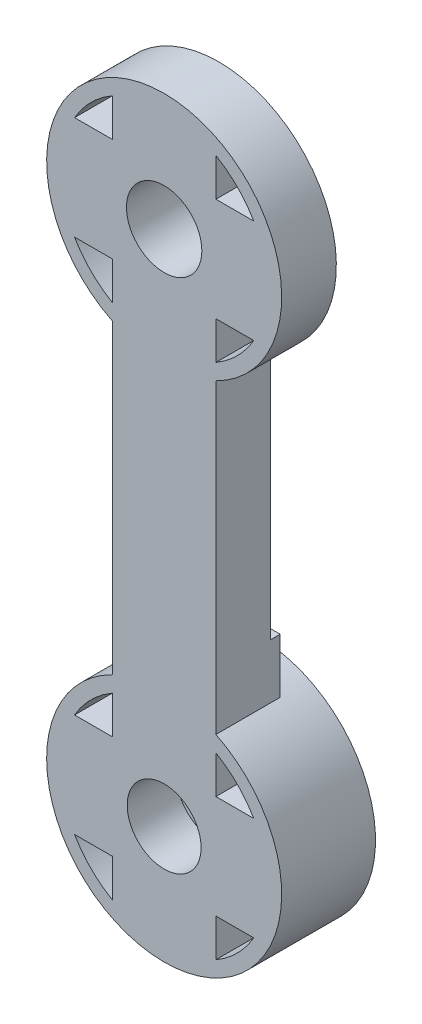
ISO-10303-21;
HEADER;
FILE_DESCRIPTION(('STEP AP214'),'2;1');
FILE_NAME('part.step','',(''),(''),'','','');
FILE_SCHEMA(('AUTOMOTIVE_DESIGN { 1 0 10303 214 1 1 1 1 }'));
ENDSEC;
DATA;
#1=APPLICATION_CONTEXT('core data for automotive mechanical design processes');
#2=APPLICATION_PROTOCOL_DEFINITION('international standard','automotive_design',2000,#1);
#3=PRODUCT_CONTEXT('',#1,'mechanical');
#4=PRODUCT('Part','Part','',(#3));
#5=PRODUCT_RELATED_PRODUCT_CATEGORY('part','',(#4));
#6=PRODUCT_DEFINITION_FORMATION('','',#4);
#7=PRODUCT_DEFINITION_CONTEXT('part definition',#1,'design');
#8=PRODUCT_DEFINITION('design','',#6,#7);
#9=PRODUCT_DEFINITION_SHAPE('','',#8);
#10=(LENGTH_UNIT() NAMED_UNIT(*) SI_UNIT(.MILLI.,.METRE.));
#11=(NAMED_UNIT(*) PLANE_ANGLE_UNIT() SI_UNIT($,.RADIAN.));
#12=(NAMED_UNIT(*) SI_UNIT($,.STERADIAN.) SOLID_ANGLE_UNIT());
#13=UNCERTAINTY_MEASURE_WITH_UNIT(LENGTH_MEASURE(1.E-05),#10,'distance_accuracy_value','');
#14=(GEOMETRIC_REPRESENTATION_CONTEXT(3) GLOBAL_UNCERTAINTY_ASSIGNED_CONTEXT((#13)) GLOBAL_UNIT_ASSIGNED_CONTEXT((#10,
#11,#12)) REPRESENTATION_CONTEXT('',''));
#15=CARTESIAN_POINT('',(0.,0.,0.));
#16=DIRECTION('',(0.,0.,1.));
#17=DIRECTION('',(1.,0.,0.));
#18=AXIS2_PLACEMENT_3D('',#15,#16,#17);
#19=CARTESIAN_POINT('',(0.,0.,-0.7));
#20=DIRECTION('',(0.,0.,-1.));
#21=DIRECTION('',(-1.,0.,0.));
#22=AXIS2_PLACEMENT_3D('',#19,#20,#21);
#23=PLANE('',#22);
#24=CARTESIAN_POINT('',(0.,0.,-0.7));
#25=DIRECTION('',(0.,0.,-1.));
#26=DIRECTION('',(-1.,0.,0.));
#27=AXIS2_PLACEMENT_3D('',#24,#25,#26);
#28=CIRCLE('',#27,2.55);
#29=CARTESIAN_POINT('',(-2.55,0.,-0.7));
#30=VERTEX_POINT('',#29);
#31=EDGE_CURVE('E277',#30,#30,#28,.T.);
#32=ORIENTED_EDGE('',*,*,#31,.F.);
#33=EDGE_LOOP('',(#32));
#34=FACE_BOUND('',#33,.T.);
#35=DIRECTION('',(0.,1.,0.));
#36=VECTOR('',#35,1.);
#37=CARTESIAN_POINT('',(-3.5,0.,-0.7));
#38=LINE('',#37,#36);
#39=CARTESIAN_POINT('',(-3.5,3.5,-0.7));
#40=VERTEX_POINT('',#39);
#41=CARTESIAN_POINT('',(-3.5,6.06217782649107,-0.7));
#42=VERTEX_POINT('',#41);
#43=EDGE_CURVE('E379',#40,#42,#38,.T.);
#44=ORIENTED_EDGE('',*,*,#43,.T.);
#45=CARTESIAN_POINT('',(0.,0.,-0.7));
#46=DIRECTION('',(0.,0.,1.));
#47=DIRECTION('',(1.,0.,0.));
#48=AXIS2_PLACEMENT_3D('',#45,#46,#47);
#49=CIRCLE('',#48,7.);
#50=CARTESIAN_POINT('',(-6.06217782649107,3.5,-0.7));
#51=VERTEX_POINT('',#50);
#52=EDGE_CURVE('E378',#42,#51,#49,.T.);
#53=ORIENTED_EDGE('',*,*,#52,.T.);
#54=DIRECTION('',(-1.,0.,0.));
#55=VECTOR('',#54,1.);
#56=CARTESIAN_POINT('',(0.,3.5,-0.7));
#57=LINE('',#56,#55);
#58=EDGE_CURVE('E382',#40,#51,#57,.T.);
#59=ORIENTED_EDGE('',*,*,#58,.F.);
#60=EDGE_LOOP('',(#44,#53,#59));
#61=FACE_BOUND('',#60,.T.);
#62=DIRECTION('',(0.,-1.,0.));
#63=VECTOR('',#62,1.);
#64=CARTESIAN_POINT('',(3.5,0.,-0.7));
#65=LINE('',#64,#63);
#66=CARTESIAN_POINT('',(3.5,-3.5,-0.7));
#67=VERTEX_POINT('',#66);
#68=CARTESIAN_POINT('',(3.5,-6.06217782649107,-0.7));
#69=VERTEX_POINT('',#68);
#70=EDGE_CURVE('E73',#67,#69,#65,.T.);
#71=ORIENTED_EDGE('',*,*,#70,.T.);
#72=CARTESIAN_POINT('',(6.06217782649107,-3.5,-0.7));
#73=VERTEX_POINT('',#72);
#74=EDGE_CURVE('E360',#69,#73,#49,.T.);
#75=ORIENTED_EDGE('',*,*,#74,.T.);
#76=DIRECTION('',(1.,0.,0.));
#77=VECTOR('',#76,1.);
#78=CARTESIAN_POINT('',(0.,-3.5,-0.7));
#79=LINE('',#78,#77);
#80=EDGE_CURVE('E363',#67,#73,#79,.T.);
#81=ORIENTED_EDGE('',*,*,#80,.F.);
#82=EDGE_LOOP('',(#71,#75,#81));
#83=FACE_BOUND('',#82,.T.);
#84=DIRECTION('',(-1.,0.,0.));
#85=VECTOR('',#84,1.);
#86=CARTESIAN_POINT('',(0.,-3.5,-0.7));
#87=LINE('',#86,#85);
#88=CARTESIAN_POINT('',(-3.5,-3.5,-0.7));
#89=VERTEX_POINT('',#88);
#90=CARTESIAN_POINT('',(-6.06217782649107,-3.5,-0.7));
#91=VERTEX_POINT('',#90);
#92=EDGE_CURVE('E375',#89,#91,#87,.T.);
#93=ORIENTED_EDGE('',*,*,#92,.T.);
#94=CARTESIAN_POINT('',(-3.5,-6.06217782649107,-0.7));
#95=VERTEX_POINT('',#94);
#96=EDGE_CURVE('E365',#91,#95,#49,.T.);
#97=ORIENTED_EDGE('',*,*,#96,.T.);
#98=DIRECTION('',(0.,-1.,0.));
#99=VECTOR('',#98,1.);
#100=CARTESIAN_POINT('',(-3.5,0.,-0.7));
#101=LINE('',#100,#99);
#102=EDGE_CURVE('E371',#89,#95,#101,.T.);
#103=ORIENTED_EDGE('',*,*,#102,.F.);
#104=EDGE_LOOP('',(#93,#97,#103));
#105=FACE_BOUND('',#104,.T.);
#106=DIRECTION('',(1.,0.,0.));
#107=VECTOR('',#106,1.);
#108=CARTESIAN_POINT('',(0.,3.5,-0.7));
#109=LINE('',#108,#107);
#110=CARTESIAN_POINT('',(3.5,3.5,-0.7));
#111=VERTEX_POINT('',#110);
#112=CARTESIAN_POINT('',(6.06217782649107,3.5,-0.7));
#113=VERTEX_POINT('',#112);
#114=EDGE_CURVE('E390',#111,#113,#109,.T.);
#115=ORIENTED_EDGE('',*,*,#114,.T.);
#116=CARTESIAN_POINT('',(3.5,6.06217782649107,-0.7));
#117=VERTEX_POINT('',#116);
#118=EDGE_CURVE('E364',#113,#117,#49,.T.);
#119=ORIENTED_EDGE('',*,*,#118,.T.);
#120=DIRECTION('',(0.,1.,0.));
#121=VECTOR('',#120,1.);
#122=CARTESIAN_POINT('',(3.5,0.,-0.7));
#123=LINE('',#122,#121);
#124=EDGE_CURVE('E386',#111,#117,#123,.T.);
#125=ORIENTED_EDGE('',*,*,#124,.F.);
#126=EDGE_LOOP('',(#115,#119,#125));
#127=FACE_BOUND('',#126,.T.);
#128=DIRECTION('',(0.,-1.,0.));
#129=VECTOR('',#128,1.);
#130=CARTESIAN_POINT('',(3.5,0.,-0.7));
#131=LINE('',#130,#129);
#132=CARTESIAN_POINT('',(3.5,-7.13810198862415,-0.7));
#133=VERTEX_POINT('',#132);
#134=CARTESIAN_POINT('',(3.5,-24.1618980113759,-0.7));
#135=VERTEX_POINT('',#134);
#136=EDGE_CURVE('E393',#133,#135,#131,.T.);
#137=ORIENTED_EDGE('',*,*,#136,.T.);
#138=DIRECTION('',(-1.,0.,0.));
#139=VECTOR('',#138,1.);
#140=CARTESIAN_POINT('',(0.,-24.1618980113759,-0.7));
#141=LINE('',#140,#139);
#142=CARTESIAN_POINT('',(-3.5,-24.1618980113759,-0.7));
#143=VERTEX_POINT('',#142);
#144=EDGE_CURVE('E334',#135,#143,#141,.T.);
#145=ORIENTED_EDGE('',*,*,#144,.T.);
#146=DIRECTION('',(0.,1.,0.));
#147=VECTOR('',#146,1.);
#148=CARTESIAN_POINT('',(-3.5,0.,-0.7));
#149=LINE('',#148,#147);
#150=CARTESIAN_POINT('',(-3.5,-7.13810198862415,-0.7));
#151=VERTEX_POINT('',#150);
#152=EDGE_CURVE('E397',#143,#151,#149,.T.);
#153=ORIENTED_EDGE('',*,*,#152,.T.);
#154=CARTESIAN_POINT('',(0.,0.,-0.7));
#155=DIRECTION('',(0.,0.,1.));
#156=DIRECTION('',(1.,0.,0.));
#157=AXIS2_PLACEMENT_3D('',#154,#155,#156);
#158=CIRCLE('',#157,7.95);
#159=EDGE_CURVE('E356',#133,#151,#158,.T.);
#160=ORIENTED_EDGE('',*,*,#159,.F.);
#161=EDGE_LOOP('',(#137,#145,#153,#160));
#162=FACE_BOUND('',#161,.T.);
#163=ADVANCED_FACE('F47',(#34,#61,#83,#105,#127,#162),#23,.T.);
#164=CARTESIAN_POINT('',(0.,0.,3.));
#165=DIRECTION('',(0.,0.,-1.));
#166=DIRECTION('',(-1.,0.,0.));
#167=AXIS2_PLACEMENT_3D('',#164,#165,#166);
#168=CYLINDRICAL_SURFACE('',#167,7.);
#169=ORIENTED_EDGE('',*,*,#118,.F.);
#170=DIRECTION('',(0.,0.,-1.));
#171=VECTOR('',#170,1.);
#172=CARTESIAN_POINT('',(6.06217782649107,3.5,3.));
#173=LINE('',#172,#171);
#174=CARTESIAN_POINT('',(6.06217782649107,3.5,3.));
#175=VERTEX_POINT('',#174);
#176=EDGE_CURVE('E11',#175,#113,#173,.T.);
#177=ORIENTED_EDGE('',*,*,#176,.F.);
#178=CARTESIAN_POINT('',(0.,0.,3.));
#179=DIRECTION('',(0.,0.,1.));
#180=DIRECTION('',(1.,0.,0.));
#181=AXIS2_PLACEMENT_3D('',#178,#179,#180);
#182=CIRCLE('',#181,7.);
#183=CARTESIAN_POINT('',(3.5,6.06217782649107,3.));
#184=VERTEX_POINT('',#183);
#185=EDGE_CURVE('E489',#175,#184,#182,.T.);
#186=ORIENTED_EDGE('',*,*,#185,.T.);
#187=DIRECTION('',(0.,0.,-1.));
#188=VECTOR('',#187,1.);
#189=CARTESIAN_POINT('',(3.5,6.06217782649107,3.));
#190=LINE('',#189,#188);
#191=EDGE_CURVE('E501',#184,#117,#190,.T.);
#192=ORIENTED_EDGE('',*,*,#191,.T.);
#193=EDGE_LOOP('',(#169,#177,#186,#192));
#194=FACE_BOUND('',#193,.T.);
#195=ADVANCED_FACE('F644',(#194),#168,.F.);
#196=ORIENTED_EDGE('',*,*,#52,.F.);
#197=DIRECTION('',(0.,0.,-1.));
#198=VECTOR('',#197,1.);
#199=CARTESIAN_POINT('',(-3.5,6.06217782649107,3.));
#200=LINE('',#199,#198);
#201=CARTESIAN_POINT('',(-3.5,6.06217782649107,3.));
#202=VERTEX_POINT('',#201);
#203=EDGE_CURVE('E513',#202,#42,#200,.T.);
#204=ORIENTED_EDGE('',*,*,#203,.F.);
#205=CARTESIAN_POINT('',(-6.06217782649107,3.5,3.));
#206=VERTEX_POINT('',#205);
#207=EDGE_CURVE('E484',#202,#206,#182,.T.);
#208=ORIENTED_EDGE('',*,*,#207,.T.);
#209=DIRECTION('',(0.,0.,-1.));
#210=VECTOR('',#209,1.);
#211=CARTESIAN_POINT('',(-6.06217782649107,3.5,3.));
#212=LINE('',#211,#210);
#213=EDGE_CURVE('E505',#206,#51,#212,.T.);
#214=ORIENTED_EDGE('',*,*,#213,.T.);
#215=EDGE_LOOP('',(#196,#204,#208,#214));
#216=FACE_BOUND('',#215,.T.);
#217=ADVANCED_FACE('F681',(#216),#168,.F.);
#218=ORIENTED_EDGE('',*,*,#96,.F.);
#219=DIRECTION('',(0.,0.,-1.));
#220=VECTOR('',#219,1.);
#221=CARTESIAN_POINT('',(-6.06217782649107,-3.5,3.));
#222=LINE('',#221,#220);
#223=CARTESIAN_POINT('',(-6.06217782649107,-3.5,3.));
#224=VERTEX_POINT('',#223);
#225=EDGE_CURVE('E521',#224,#91,#222,.T.);
#226=ORIENTED_EDGE('',*,*,#225,.F.);
#227=CARTESIAN_POINT('',(0.,0.,3.));
#228=DIRECTION('',(0.,0.,1.));
#229=DIRECTION('',(1.,0.,0.));
#230=AXIS2_PLACEMENT_3D('',#227,#228,#229);
#231=CIRCLE('',#230,7.);
#232=CARTESIAN_POINT('',(-3.5,-6.06217782649107,3.));
#233=VERTEX_POINT('',#232);
#234=EDGE_CURVE('E477',#224,#233,#231,.T.);
#235=ORIENTED_EDGE('',*,*,#234,.T.);
#236=DIRECTION('',(0.,0.,-1.));
#237=VECTOR('',#236,1.);
#238=CARTESIAN_POINT('',(-3.5,-6.06217782649107,3.));
#239=LINE('',#238,#237);
#240=EDGE_CURVE('E525',#233,#95,#239,.T.);
#241=ORIENTED_EDGE('',*,*,#240,.T.);
#242=EDGE_LOOP('',(#218,#226,#235,#241));
#243=FACE_BOUND('',#242,.T.);
#244=ADVANCED_FACE('F659',(#243),#168,.F.);
#245=CARTESIAN_POINT('',(0.,-35.,3.));
#246=DIRECTION('',(0.,0.,-1.));
#247=DIRECTION('',(-1.,0.,0.));
#248=AXIS2_PLACEMENT_3D('',#245,#246,#247);
#249=CYLINDRICAL_SURFACE('',#248,7.95);
#250=DIRECTION('',(0.,0.,-1.));
#251=VECTOR('',#250,1.);
#252=CARTESIAN_POINT('',(-3.5,-27.8618980113759,3.));
#253=LINE('',#252,#251);
#254=CARTESIAN_POINT('',(-3.5,-27.8618980113759,3.));
#255=VERTEX_POINT('',#254);
#256=CARTESIAN_POINT('',(-3.5,-27.8618980113759,-1.35));
#257=VERTEX_POINT('',#256);
#258=EDGE_CURVE('E554',#255,#257,#253,.T.);
#259=ORIENTED_EDGE('',*,*,#258,.T.);
#260=CARTESIAN_POINT('',(0.,-35.,-1.35));
#261=DIRECTION('',(0.,0.,-1.));
#262=DIRECTION('',(-1.,0.,0.));
#263=AXIS2_PLACEMENT_3D('',#260,#261,#262);
#264=CIRCLE('',#263,7.95);
#265=CARTESIAN_POINT('',(3.5,-27.8618980113759,-1.35));
#266=VERTEX_POINT('',#265);
#267=EDGE_CURVE('E335',#257,#266,#264,.T.);
#268=ORIENTED_EDGE('',*,*,#267,.T.);
#269=DIRECTION('',(0.,0.,-1.));
#270=VECTOR('',#269,1.);
#271=CARTESIAN_POINT('',(3.5,-27.8618980113759,3.));
#272=LINE('',#271,#270);
#273=CARTESIAN_POINT('',(3.5,-27.8618980113759,3.));
#274=VERTEX_POINT('',#273);
#275=EDGE_CURVE('E566',#274,#266,#272,.T.);
#276=ORIENTED_EDGE('',*,*,#275,.F.);
#277=CARTESIAN_POINT('',(0.,-35.,3.));
#278=DIRECTION('',(0.,0.,1.));
#279=DIRECTION('',(1.,0.,0.));
#280=AXIS2_PLACEMENT_3D('',#277,#278,#279);
#281=CIRCLE('',#280,7.95);
#282=EDGE_CURVE('E430',#274,#255,#281,.F.);
#283=ORIENTED_EDGE('',*,*,#282,.T.);
#284=EDGE_LOOP('',(#259,#268,#276,#283));
#285=FACE_BOUND('',#284,.T.);
#286=CARTESIAN_POINT('',(0.,-35.,-3.35));
#287=DIRECTION('',(0.,0.,-1.));
#288=DIRECTION('',(-1.,0.,0.));
#289=AXIS2_PLACEMENT_3D('',#286,#287,#288);
#290=CIRCLE('',#289,7.95);
#291=CARTESIAN_POINT('',(-7.95,-35.,-3.35));
#292=VERTEX_POINT('',#291);
#293=EDGE_CURVE('E326',#292,#292,#290,.T.);
#294=ORIENTED_EDGE('',*,*,#293,.F.);
#295=EDGE_LOOP('',(#294));
#296=FACE_BOUND('',#295,.T.);
#297=ADVANCED_FACE('F724',(#285,#296),#249,.T.);
#298=CARTESIAN_POINT('',(0.,0.,3.));
#299=DIRECTION('',(0.,0.,-1.));
#300=DIRECTION('',(-1.,0.,0.));
#301=AXIS2_PLACEMENT_3D('',#298,#299,#300);
#302=CYLINDRICAL_SURFACE('',#301,7.95);
#303=ORIENTED_EDGE('',*,*,#159,.T.);
#304=DIRECTION('',(0.,0.,-1.));
#305=VECTOR('',#304,1.);
#306=CARTESIAN_POINT('',(-3.5,-7.13810198862415,3.));
#307=LINE('',#306,#305);
#308=CARTESIAN_POINT('',(-3.5,-7.13810198862415,3.));
#309=VERTEX_POINT('',#308);
#310=EDGE_CURVE('E557',#309,#151,#307,.T.);
#311=ORIENTED_EDGE('',*,*,#310,.F.);
#312=CARTESIAN_POINT('',(0.,0.,3.));
#313=DIRECTION('',(0.,0.,1.));
#314=DIRECTION('',(1.,0.,0.));
#315=AXIS2_PLACEMENT_3D('',#312,#313,#314);
#316=CIRCLE('',#315,7.95);
#317=CARTESIAN_POINT('',(3.5,-7.13810198862415,3.));
#318=VERTEX_POINT('',#317);
#319=EDGE_CURVE('E438',#318,#309,#316,.T.);
#320=ORIENTED_EDGE('',*,*,#319,.F.);
#321=DIRECTION('',(0.,0.,-1.));
#322=VECTOR('',#321,1.);
#323=CARTESIAN_POINT('',(3.5,-7.13810198862415,3.));
#324=LINE('',#323,#322);
#325=EDGE_CURVE('E561',#318,#133,#324,.T.);
#326=ORIENTED_EDGE('',*,*,#325,.T.);
#327=EDGE_LOOP('',(#303,#311,#320,#326));
#328=FACE_BOUND('',#327,.T.);
#329=ADVANCED_FACE('F700',(#328),#302,.T.);
#330=CARTESIAN_POINT('',(0.,-35.,3.));
#331=DIRECTION('',(0.,0.,-1.));
#332=DIRECTION('',(-1.,0.,0.));
#333=AXIS2_PLACEMENT_3D('',#330,#331,#332);
#334=CYLINDRICAL_SURFACE('',#333,1.5);
#335=CARTESIAN_POINT('',(0.,-35.,-0.35));
#336=DIRECTION('',(0.,0.,1.));
#337=DIRECTION('',(1.,0.,0.));
#338=AXIS2_PLACEMENT_3D('',#335,#336,#337);
#339=CIRCLE('',#338,1.5);
#340=CARTESIAN_POINT('',(1.5,-35.,-0.35));
#341=VERTEX_POINT('',#340);
#342=EDGE_CURVE('E51',#341,#341,#339,.F.);
#343=ORIENTED_EDGE('',*,*,#342,.F.);
#344=EDGE_LOOP('',(#343));
#345=FACE_BOUND('',#344,.T.);
#346=CARTESIAN_POINT('',(0.,-35.,-3.35));
#347=DIRECTION('',(0.,0.,-1.));
#348=DIRECTION('',(-1.,0.,0.));
#349=AXIS2_PLACEMENT_3D('',#346,#347,#348);
#350=CIRCLE('',#349,1.5);
#351=CARTESIAN_POINT('',(-1.5,-35.,-3.35));
#352=VERTEX_POINT('',#351);
#353=EDGE_CURVE('E330',#352,#352,#350,.F.);
#354=ORIENTED_EDGE('',*,*,#353,.F.);
#355=EDGE_LOOP('',(#354));
#356=FACE_BOUND('',#355,.T.);
#357=ADVANCED_FACE('F696',(#345,#356),#334,.F.);
#358=CARTESIAN_POINT('',(0.,-31.5,3.));
#359=DIRECTION('',(0.,-1.,0.));
#360=DIRECTION('',(0.,0.,-1.));
#361=AXIS2_PLACEMENT_3D('',#358,#359,#360);
#362=PLANE('',#361);
#363=DIRECTION('',(0.,0.,-1.));
#364=VECTOR('',#363,1.);
#365=CARTESIAN_POINT('',(6.06217782649107,-31.5,3.));
#366=LINE('',#365,#364);
#367=CARTESIAN_POINT('',(6.06217782649107,-31.5,3.));
#368=VERTEX_POINT('',#367);
#369=CARTESIAN_POINT('',(6.06217782649107,-31.5,-3.35));
#370=VERTEX_POINT('',#369);
#371=EDGE_CURVE('E533',#368,#370,#366,.T.);
#372=ORIENTED_EDGE('',*,*,#371,.T.);
#373=DIRECTION('',(1.,0.,0.));
#374=VECTOR('',#373,1.);
#375=CARTESIAN_POINT('',(0.,-31.5,-3.35));
#376=LINE('',#375,#374);
#377=CARTESIAN_POINT('',(3.5,-31.5,-3.35));
#378=VERTEX_POINT('',#377);
#379=EDGE_CURVE('E299',#378,#370,#376,.T.);
#380=ORIENTED_EDGE('',*,*,#379,.F.);
#381=DIRECTION('',(0.,0.,-1.));
#382=VECTOR('',#381,1.);
#383=CARTESIAN_POINT('',(3.5,-31.5,3.));
#384=LINE('',#383,#382);
#385=CARTESIAN_POINT('',(3.5,-31.5,3.));
#386=VERTEX_POINT('',#385);
#387=EDGE_CURVE('E526',#386,#378,#384,.T.);
#388=ORIENTED_EDGE('',*,*,#387,.F.);
#389=DIRECTION('',(-1.,0.,0.));
#390=VECTOR('',#389,1.);
#391=CARTESIAN_POINT('',(0.,-31.5,3.));
#392=LINE('',#391,#390);
#393=EDGE_CURVE('E460',#368,#386,#392,.T.);
#394=ORIENTED_EDGE('',*,*,#393,.F.);
#395=EDGE_LOOP('',(#372,#380,#388,#394));
#396=FACE_BOUND('',#395,.T.);
#397=ADVANCED_FACE('F699',(#396),#362,.F.);
#398=CARTESIAN_POINT('',(3.5,0.,3.));
#399=DIRECTION('',(1.,0.,0.));
#400=DIRECTION('',(0.,1.,0.));
#401=AXIS2_PLACEMENT_3D('',#398,#399,#400);
#402=PLANE('',#401);
#403=ORIENTED_EDGE('',*,*,#387,.T.);
#404=DIRECTION('',(0.,-1.,0.));
#405=VECTOR('',#404,1.);
#406=CARTESIAN_POINT('',(3.5,0.,-3.35));
#407=LINE('',#406,#405);
#408=CARTESIAN_POINT('',(3.5,-28.9378221735089,-3.35));
#409=VERTEX_POINT('',#408);
#410=EDGE_CURVE('E292',#409,#378,#407,.T.);
#411=ORIENTED_EDGE('',*,*,#410,.F.);
#412=DIRECTION('',(0.,0.,-1.));
#413=VECTOR('',#412,1.);
#414=CARTESIAN_POINT('',(3.5,-28.9378221735089,3.));
#415=LINE('',#414,#413);
#416=CARTESIAN_POINT('',(3.5,-28.9378221735089,3.));
#417=VERTEX_POINT('',#416);
#418=EDGE_CURVE('E536',#417,#409,#415,.T.);
#419=ORIENTED_EDGE('',*,*,#418,.F.);
#420=DIRECTION('',(0.,-1.,0.));
#421=VECTOR('',#420,1.);
#422=CARTESIAN_POINT('',(3.5,0.,3.));
#423=LINE('',#422,#421);
#424=EDGE_CURVE('E463',#417,#386,#423,.T.);
#425=ORIENTED_EDGE('',*,*,#424,.T.);
#426=EDGE_LOOP('',(#403,#411,#419,#425));
#427=FACE_BOUND('',#426,.T.);
#428=ADVANCED_FACE('F786',(#427),#402,.T.);
#429=CARTESIAN_POINT('',(0.,-31.5,3.));
#430=DIRECTION('',(0.,-1.,0.));
#431=DIRECTION('',(0.,0.,-1.));
#432=AXIS2_PLACEMENT_3D('',#429,#430,#431);
#433=PLANE('',#432);
#434=DIRECTION('',(0.,0.,-1.));
#435=VECTOR('',#434,1.);
#436=CARTESIAN_POINT('',(-3.5,-31.5,3.));
#437=LINE('',#436,#435);
#438=CARTESIAN_POINT('',(-3.5,-31.5,3.));
#439=VERTEX_POINT('',#438);
#440=CARTESIAN_POINT('',(-3.5,-31.5,-3.35));
#441=VERTEX_POINT('',#440);
#442=EDGE_CURVE('E267',#439,#441,#437,.T.);
#443=ORIENTED_EDGE('',*,*,#442,.T.);
#444=DIRECTION('',(1.,0.,0.));
#445=VECTOR('',#444,1.);
#446=CARTESIAN_POINT('',(0.,-31.5,-3.35));
#447=LINE('',#446,#445);
#448=CARTESIAN_POINT('',(-6.06217782649107,-31.5,-3.35));
#449=VERTEX_POINT('',#448);
#450=EDGE_CURVE('E264',#449,#441,#447,.T.);
#451=ORIENTED_EDGE('',*,*,#450,.F.);
#452=DIRECTION('',(0.,0.,-1.));
#453=VECTOR('',#452,1.);
#454=CARTESIAN_POINT('',(-6.06217782649107,-31.5,3.));
#455=LINE('',#454,#453);
#456=CARTESIAN_POINT('',(-6.06217782649107,-31.5,3.));
#457=VERTEX_POINT('',#456);
#458=EDGE_CURVE('E249',#457,#449,#455,.T.);
#459=ORIENTED_EDGE('',*,*,#458,.F.);
#460=DIRECTION('',(-1.,0.,0.));
#461=VECTOR('',#460,1.);
#462=CARTESIAN_POINT('',(0.,-31.5,3.));
#463=LINE('',#462,#461);
#464=EDGE_CURVE('E441',#439,#457,#463,.T.);
#465=ORIENTED_EDGE('',*,*,#464,.F.);
#466=EDGE_LOOP('',(#443,#451,#459,#465));
#467=FACE_BOUND('',#466,.T.);
#468=ADVANCED_FACE('F265',(#467),#433,.F.);
#469=CARTESIAN_POINT('',(0.,-35.,3.));
#470=DIRECTION('',(0.,0.,-1.));
#471=DIRECTION('',(-1.,0.,0.));
#472=AXIS2_PLACEMENT_3D('',#469,#470,#471);
#473=CYLINDRICAL_SURFACE('',#472,7.);
#474=ORIENTED_EDGE('',*,*,#458,.T.);
#475=CARTESIAN_POINT('',(0.,-35.,-3.35));
#476=DIRECTION('',(0.,0.,-1.));
#477=DIRECTION('',(-1.,0.,0.));
#478=AXIS2_PLACEMENT_3D('',#475,#476,#477);
#479=CIRCLE('',#478,7.);
#480=CARTESIAN_POINT('',(-3.5,-28.9378221735089,-3.35));
#481=VERTEX_POINT('',#480);
#482=EDGE_CURVE('E254',#449,#481,#479,.T.);
#483=ORIENTED_EDGE('',*,*,#482,.T.);
#484=DIRECTION('',(0.,0.,-1.));
#485=VECTOR('',#484,1.);
#486=CARTESIAN_POINT('',(-3.5,-28.9378221735089,3.));
#487=LINE('',#486,#485);
#488=CARTESIAN_POINT('',(-3.5,-28.9378221735089,3.));
#489=VERTEX_POINT('',#488);
#490=EDGE_CURVE('E261',#489,#481,#487,.T.);
#491=ORIENTED_EDGE('',*,*,#490,.F.);
#492=CARTESIAN_POINT('',(0.,-35.,3.));
#493=DIRECTION('',(0.,0.,1.));
#494=DIRECTION('',(1.,0.,0.));
#495=AXIS2_PLACEMENT_3D('',#492,#493,#494);
#496=CIRCLE('',#495,7.);
#497=EDGE_CURVE('E255',#457,#489,#496,.F.);
#498=ORIENTED_EDGE('',*,*,#497,.F.);
#499=EDGE_LOOP('',(#474,#483,#491,#498));
#500=FACE_BOUND('',#499,.T.);
#501=ADVANCED_FACE('F251',(#500),#473,.F.);
#502=CARTESIAN_POINT('',(3.50000000000003,0.,3.));
#503=DIRECTION('',(1.,0.,0.));
#504=DIRECTION('',(0.,1.,0.));
#505=AXIS2_PLACEMENT_3D('',#502,#503,#504);
#506=PLANE('',#505);
#507=DIRECTION('',(0.,0.,-1.));
#508=VECTOR('',#507,1.);
#509=CARTESIAN_POINT('',(3.5,-41.0621778264911,3.));
#510=LINE('',#509,#508);
#511=CARTESIAN_POINT('',(3.5,-41.0621778264911,3.));
#512=VERTEX_POINT('',#511);
#513=CARTESIAN_POINT('',(3.5,-41.0621778264911,-3.35));
#514=VERTEX_POINT('',#513);
#515=EDGE_CURVE('E571',#512,#514,#510,.T.);
#516=ORIENTED_EDGE('',*,*,#515,.T.);
#517=DIRECTION('',(0.,-1.,0.));
#518=VECTOR('',#517,1.);
#519=CARTESIAN_POINT('',(3.50000000000003,0.,-3.35));
#520=LINE('',#519,#518);
#521=CARTESIAN_POINT('',(3.5,-38.5,-3.35));
#522=VERTEX_POINT('',#521);
#523=EDGE_CURVE('E311',#522,#514,#520,.T.);
#524=ORIENTED_EDGE('',*,*,#523,.F.);
#525=DIRECTION('',(0.,0.,-1.));
#526=VECTOR('',#525,1.);
#527=CARTESIAN_POINT('',(3.5,-38.5,3.));
#528=LINE('',#527,#526);
#529=CARTESIAN_POINT('',(3.5,-38.5,3.));
#530=VERTEX_POINT('',#529);
#531=EDGE_CURVE('E562',#530,#522,#528,.T.);
#532=ORIENTED_EDGE('',*,*,#531,.F.);
#533=DIRECTION('',(0.,-1.,0.));
#534=VECTOR('',#533,1.);
#535=CARTESIAN_POINT('',(3.50000000000003,0.,3.));
#536=LINE('',#535,#534);
#537=EDGE_CURVE('E418',#530,#512,#536,.T.);
#538=ORIENTED_EDGE('',*,*,#537,.T.);
#539=EDGE_LOOP('',(#516,#524,#532,#538));
#540=FACE_BOUND('',#539,.T.);
#541=ADVANCED_FACE('F749',(#540),#506,.T.);
#542=CARTESIAN_POINT('',(0.,-38.5,3.));
#543=DIRECTION('',(0.,-1.,0.));
#544=DIRECTION('',(0.,0.,-1.));
#545=AXIS2_PLACEMENT_3D('',#542,#543,#544);
#546=PLANE('',#545);
#547=ORIENTED_EDGE('',*,*,#531,.T.);
#548=DIRECTION('',(-1.,0.,0.));
#549=VECTOR('',#548,1.);
#550=CARTESIAN_POINT('',(0.,-38.5,-3.35));
#551=LINE('',#550,#549);
#552=CARTESIAN_POINT('',(6.06217782649107,-38.5,-3.35));
#553=VERTEX_POINT('',#552);
#554=EDGE_CURVE('E304',#553,#522,#551,.T.);
#555=ORIENTED_EDGE('',*,*,#554,.F.);
#556=DIRECTION('',(0.,0.,-1.));
#557=VECTOR('',#556,1.);
#558=CARTESIAN_POINT('',(6.06217782649107,-38.5,3.));
#559=LINE('',#558,#557);
#560=CARTESIAN_POINT('',(6.06217782649107,-38.5,3.));
#561=VERTEX_POINT('',#560);
#562=EDGE_CURVE('E574',#561,#553,#559,.T.);
#563=ORIENTED_EDGE('',*,*,#562,.F.);
#564=DIRECTION('',(-1.,0.,0.));
#565=VECTOR('',#564,1.);
#566=CARTESIAN_POINT('',(0.,-38.5,3.));
#567=LINE('',#566,#565);
#568=EDGE_CURVE('E423',#561,#530,#567,.T.);
#569=ORIENTED_EDGE('',*,*,#568,.T.);
#570=EDGE_LOOP('',(#547,#555,#563,#569));
#571=FACE_BOUND('',#570,.T.);
#572=ADVANCED_FACE('F746',(#571),#546,.T.);
#573=CARTESIAN_POINT('',(0.,-38.5,3.));
#574=DIRECTION('',(0.,-1.,0.));
#575=DIRECTION('',(0.,0.,-1.));
#576=AXIS2_PLACEMENT_3D('',#573,#574,#575);
#577=PLANE('',#576);
#578=DIRECTION('',(0.,0.,-1.));
#579=VECTOR('',#578,1.);
#580=CARTESIAN_POINT('',(-6.06217782649107,-38.5,3.));
#581=LINE('',#580,#579);
#582=CARTESIAN_POINT('',(-6.06217782649107,-38.5,3.));
#583=VERTEX_POINT('',#582);
#584=CARTESIAN_POINT('',(-6.06217782649107,-38.5,-3.35));
#585=VERTEX_POINT('',#584);
#586=EDGE_CURVE('E500',#583,#585,#581,.T.);
#587=ORIENTED_EDGE('',*,*,#586,.T.);
#588=DIRECTION('',(-1.,0.,0.));
#589=VECTOR('',#588,1.);
#590=CARTESIAN_POINT('',(0.,-38.5,-3.35));
#591=LINE('',#590,#589);
#592=CARTESIAN_POINT('',(-3.5,-38.5,-3.35));
#593=VERTEX_POINT('',#592);
#594=EDGE_CURVE('E288',#593,#585,#591,.T.);
#595=ORIENTED_EDGE('',*,*,#594,.F.);
#596=DIRECTION('',(0.,0.,-1.));
#597=VECTOR('',#596,1.);
#598=CARTESIAN_POINT('',(-3.5,-38.5,3.));
#599=LINE('',#598,#597);
#600=CARTESIAN_POINT('',(-3.5,-38.5,3.));
#601=VERTEX_POINT('',#600);
#602=EDGE_CURVE('E575',#601,#593,#599,.T.);
#603=ORIENTED_EDGE('',*,*,#602,.F.);
#604=DIRECTION('',(-1.,0.,0.));
#605=VECTOR('',#604,1.);
#606=CARTESIAN_POINT('',(0.,-38.5,3.));
#607=LINE('',#606,#605);
#608=EDGE_CURVE('E408',#601,#583,#607,.T.);
#609=ORIENTED_EDGE('',*,*,#608,.T.);
#610=EDGE_LOOP('',(#587,#595,#603,#609));
#611=FACE_BOUND('',#610,.T.);
#612=ADVANCED_FACE('F49',(#611),#577,.T.);
#613=CARTESIAN_POINT('',(-3.5,0.,3.));
#614=DIRECTION('',(1.,0.,0.));
#615=DIRECTION('',(0.,0.,-1.));
#616=AXIS2_PLACEMENT_3D('',#613,#614,#615);
#617=PLANE('',#616);
#618=ORIENTED_EDGE('',*,*,#602,.T.);
#619=DIRECTION('',(0.,1.,0.));
#620=VECTOR('',#619,1.);
#621=CARTESIAN_POINT('',(-3.5,0.,-3.35));
#622=LINE('',#621,#620);
#623=CARTESIAN_POINT('',(-3.5,-41.0621778264911,-3.35));
#624=VERTEX_POINT('',#623);
#625=EDGE_CURVE('E287',#624,#593,#622,.T.);
#626=ORIENTED_EDGE('',*,*,#625,.F.);
#627=DIRECTION('',(0.,0.,-1.));
#628=VECTOR('',#627,1.);
#629=CARTESIAN_POINT('',(-3.5,-41.0621778264911,3.));
#630=LINE('',#629,#628);
#631=CARTESIAN_POINT('',(-3.5,-41.0621778264911,3.));
#632=VERTEX_POINT('',#631);
#633=EDGE_CURVE('E582',#632,#624,#630,.T.);
#634=ORIENTED_EDGE('',*,*,#633,.F.);
#635=DIRECTION('',(0.,-1.,0.));
#636=VECTOR('',#635,1.);
#637=CARTESIAN_POINT('',(-3.5,0.,3.));
#638=LINE('',#637,#636);
#639=EDGE_CURVE('E412',#601,#632,#638,.T.);
#640=ORIENTED_EDGE('',*,*,#639,.F.);
#641=EDGE_LOOP('',(#618,#626,#634,#640));
#642=FACE_BOUND('',#641,.T.);
#643=ADVANCED_FACE('F588',(#642),#617,.F.);
#644=CARTESIAN_POINT('',(0.,-35.,3.));
#645=DIRECTION('',(0.,0.,-1.));
#646=DIRECTION('',(-1.,0.,0.));
#647=AXIS2_PLACEMENT_3D('',#644,#645,#646);
#648=CYLINDRICAL_SURFACE('',#647,7.);
#649=ORIENTED_EDGE('',*,*,#418,.T.);
#650=EDGE_CURVE('E280',#409,#370,#479,.T.);
#651=ORIENTED_EDGE('',*,*,#650,.T.);
#652=ORIENTED_EDGE('',*,*,#371,.F.);
#653=CARTESIAN_POINT('',(0.,-35.,3.));
#654=DIRECTION('',(0.,0.,1.));
#655=DIRECTION('',(1.,0.,0.));
#656=AXIS2_PLACEMENT_3D('',#653,#654,#655);
#657=CIRCLE('',#656,7.);
#658=EDGE_CURVE('E467',#417,#368,#657,.F.);
#659=ORIENTED_EDGE('',*,*,#658,.F.);
#660=EDGE_LOOP('',(#649,#651,#652,#659));
#661=FACE_BOUND('',#660,.T.);
#662=ADVANCED_FACE('F754',(#661),#648,.F.);
#663=CARTESIAN_POINT('',(-3.5,0.,3.));
#664=DIRECTION('',(1.,0.,0.));
#665=DIRECTION('',(0.,0.,-1.));
#666=AXIS2_PLACEMENT_3D('',#663,#664,#665);
#667=PLANE('',#666);
#668=ORIENTED_EDGE('',*,*,#490,.T.);
#669=DIRECTION('',(0.,1.,0.));
#670=VECTOR('',#669,1.);
#671=CARTESIAN_POINT('',(-3.5,0.,-3.35));
#672=LINE('',#671,#670);
#673=EDGE_CURVE('E272',#441,#481,#672,.T.);
#674=ORIENTED_EDGE('',*,*,#673,.F.);
#675=ORIENTED_EDGE('',*,*,#442,.F.);
#676=DIRECTION('',(0.,-1.,0.));
#677=VECTOR('',#676,1.);
#678=CARTESIAN_POINT('',(-3.5,0.,3.));
#679=LINE('',#678,#677);
#680=EDGE_CURVE('E446',#489,#439,#679,.T.);
#681=ORIENTED_EDGE('',*,*,#680,.F.);
#682=EDGE_LOOP('',(#668,#674,#675,#681));
#683=FACE_BOUND('',#682,.T.);
#684=ADVANCED_FACE('F745',(#683),#667,.F.);
#685=CARTESIAN_POINT('',(0.,-35.,3.));
#686=DIRECTION('',(0.,0.,-1.));
#687=DIRECTION('',(-1.,0.,0.));
#688=AXIS2_PLACEMENT_3D('',#685,#686,#687);
#689=CYLINDRICAL_SURFACE('',#688,7.);
#690=ORIENTED_EDGE('',*,*,#562,.T.);
#691=EDGE_CURVE('E289',#553,#514,#479,.T.);
#692=ORIENTED_EDGE('',*,*,#691,.T.);
#693=ORIENTED_EDGE('',*,*,#515,.F.);
#694=CARTESIAN_POINT('',(0.,-35.,3.));
#695=DIRECTION('',(0.,0.,1.));
#696=DIRECTION('',(1.,0.,0.));
#697=AXIS2_PLACEMENT_3D('',#694,#695,#696);
#698=CIRCLE('',#697,7.);
#699=EDGE_CURVE('E419',#561,#512,#698,.F.);
#700=ORIENTED_EDGE('',*,*,#699,.F.);
#701=EDGE_LOOP('',(#690,#692,#693,#700));
#702=FACE_BOUND('',#701,.T.);
#703=ADVANCED_FACE('F742',(#702),#689,.F.);
#704=ORIENTED_EDGE('',*,*,#633,.T.);
#705=EDGE_CURVE('E279',#624,#585,#479,.T.);
#706=ORIENTED_EDGE('',*,*,#705,.T.);
#707=ORIENTED_EDGE('',*,*,#586,.F.);
#708=EDGE_CURVE('E415',#632,#583,#698,.F.);
#709=ORIENTED_EDGE('',*,*,#708,.F.);
#710=EDGE_LOOP('',(#704,#706,#707,#709));
#711=FACE_BOUND('',#710,.T.);
#712=ADVANCED_FACE('F599',(#711),#689,.F.);
#713=CARTESIAN_POINT('',(0.,3.5,3.));
#714=DIRECTION('',(0.,1.,0.));
#715=DIRECTION('',(0.,0.,1.));
#716=AXIS2_PLACEMENT_3D('',#713,#714,#715);
#717=PLANE('',#716);
#718=ORIENTED_EDGE('',*,*,#114,.F.);
#719=DIRECTION('',(0.,0.,-1.));
#720=VECTOR('',#719,1.);
#721=CARTESIAN_POINT('',(3.5,3.5,3.));
#722=LINE('',#721,#720);
#723=CARTESIAN_POINT('',(3.5,3.5,3.));
#724=VERTEX_POINT('',#723);
#725=EDGE_CURVE('E57',#724,#111,#722,.T.);
#726=ORIENTED_EDGE('',*,*,#725,.F.);
#727=DIRECTION('',(1.,0.,0.));
#728=VECTOR('',#727,1.);
#729=CARTESIAN_POINT('',(0.,3.5,3.));
#730=LINE('',#729,#728);
#731=EDGE_CURVE('E493',#724,#175,#730,.T.);
#732=ORIENTED_EDGE('',*,*,#731,.T.);
#733=ORIENTED_EDGE('',*,*,#176,.T.);
#734=EDGE_LOOP('',(#718,#726,#732,#733));
#735=FACE_BOUND('',#734,.T.);
#736=ADVANCED_FACE('F640',(#735),#717,.T.);
#737=CARTESIAN_POINT('',(0.,3.5,3.));
#738=DIRECTION('',(0.,-1.,0.));
#739=DIRECTION('',(0.,0.,-1.));
#740=AXIS2_PLACEMENT_3D('',#737,#738,#739);
#741=PLANE('',#740);
#742=DIRECTION('',(0.,0.,-1.));
#743=VECTOR('',#742,1.);
#744=CARTESIAN_POINT('',(-3.5,3.5,3.));
#745=LINE('',#744,#743);
#746=CARTESIAN_POINT('',(-3.5,3.5,3.));
#747=VERTEX_POINT('',#746);
#748=EDGE_CURVE('E509',#747,#40,#745,.T.);
#749=ORIENTED_EDGE('',*,*,#748,.T.);
#750=ORIENTED_EDGE('',*,*,#58,.T.);
#751=ORIENTED_EDGE('',*,*,#213,.F.);
#752=DIRECTION('',(-1.,0.,0.));
#753=VECTOR('',#752,1.);
#754=CARTESIAN_POINT('',(0.,3.5,3.));
#755=LINE('',#754,#753);
#756=EDGE_CURVE('E481',#747,#206,#755,.T.);
#757=ORIENTED_EDGE('',*,*,#756,.F.);
#758=EDGE_LOOP('',(#749,#750,#751,#757));
#759=FACE_BOUND('',#758,.T.);
#760=ADVANCED_FACE('F663',(#759),#741,.F.);
#761=CARTESIAN_POINT('',(0.,-3.5,3.));
#762=DIRECTION('',(0.,-1.,0.));
#763=DIRECTION('',(0.,0.,-1.));
#764=AXIS2_PLACEMENT_3D('',#761,#762,#763);
#765=PLANE('',#764);
#766=ORIENTED_EDGE('',*,*,#92,.F.);
#767=DIRECTION('',(0.,0.,-1.));
#768=VECTOR('',#767,1.);
#769=CARTESIAN_POINT('',(-3.5,-3.5,3.));
#770=LINE('',#769,#768);
#771=CARTESIAN_POINT('',(-3.5,-3.5,3.));
#772=VERTEX_POINT('',#771);
#773=EDGE_CURVE('E514',#772,#89,#770,.T.);
#774=ORIENTED_EDGE('',*,*,#773,.F.);
#775=DIRECTION('',(-1.,0.,0.));
#776=VECTOR('',#775,1.);
#777=CARTESIAN_POINT('',(0.,-3.5,3.));
#778=LINE('',#777,#776);
#779=EDGE_CURVE('E470',#772,#224,#778,.T.);
#780=ORIENTED_EDGE('',*,*,#779,.T.);
#781=ORIENTED_EDGE('',*,*,#225,.T.);
#782=EDGE_LOOP('',(#766,#774,#780,#781));
#783=FACE_BOUND('',#782,.T.);
#784=ADVANCED_FACE('F661',(#783),#765,.T.);
#785=CARTESIAN_POINT('',(-3.5,0.,3.));
#786=DIRECTION('',(1.,0.,0.));
#787=DIRECTION('',(0.,0.,-1.));
#788=AXIS2_PLACEMENT_3D('',#785,#786,#787);
#789=PLANE('',#788);
#790=ORIENTED_EDGE('',*,*,#773,.T.);
#791=ORIENTED_EDGE('',*,*,#102,.T.);
#792=ORIENTED_EDGE('',*,*,#240,.F.);
#793=DIRECTION('',(0.,-1.,0.));
#794=VECTOR('',#793,1.);
#795=CARTESIAN_POINT('',(-3.5,0.,3.));
#796=LINE('',#795,#794);
#797=EDGE_CURVE('E474',#772,#233,#796,.T.);
#798=ORIENTED_EDGE('',*,*,#797,.F.);
#799=EDGE_LOOP('',(#790,#791,#792,#798));
#800=FACE_BOUND('',#799,.T.);
#801=ADVANCED_FACE('F657',(#800),#789,.F.);
#802=CARTESIAN_POINT('',(3.5,0.,3.));
#803=DIRECTION('',(1.,0.,0.));
#804=DIRECTION('',(0.,1.,0.));
#805=AXIS2_PLACEMENT_3D('',#802,#803,#804);
#806=PLANE('',#805);
#807=ORIENTED_EDGE('',*,*,#70,.F.);
#808=DIRECTION('',(0.,0.,-1.));
#809=VECTOR('',#808,1.);
#810=CARTESIAN_POINT('',(3.5,-3.5,3.));
#811=LINE('',#810,#809);
#812=CARTESIAN_POINT('',(3.5,-3.5,3.));
#813=VERTEX_POINT('',#812);
#814=EDGE_CURVE('E545',#813,#67,#811,.T.);
#815=ORIENTED_EDGE('',*,*,#814,.F.);
#816=DIRECTION('',(0.,-1.,0.));
#817=VECTOR('',#816,1.);
#818=CARTESIAN_POINT('',(3.5,0.,3.));
#819=LINE('',#818,#817);
#820=CARTESIAN_POINT('',(3.5,-6.06217782649107,3.));
#821=VERTEX_POINT('',#820);
#822=EDGE_CURVE('E453',#813,#821,#819,.T.);
#823=ORIENTED_EDGE('',*,*,#822,.T.);
#824=DIRECTION('',(0.,0.,-1.));
#825=VECTOR('',#824,1.);
#826=CARTESIAN_POINT('',(3.5,-6.06217782649107,3.));
#827=LINE('',#826,#825);
#828=EDGE_CURVE('E537',#821,#69,#827,.T.);
#829=ORIENTED_EDGE('',*,*,#828,.T.);
#830=EDGE_LOOP('',(#807,#815,#823,#829));
#831=FACE_BOUND('',#830,.T.);
#832=ADVANCED_FACE('F669',(#831),#806,.T.);
#833=CARTESIAN_POINT('',(3.5,0.,3.));
#834=DIRECTION('',(-1.,0.,0.));
#835=DIRECTION('',(0.,0.,1.));
#836=AXIS2_PLACEMENT_3D('',#833,#834,#835);
#837=PLANE('',#836);
#838=ORIENTED_EDGE('',*,*,#725,.T.);
#839=ORIENTED_EDGE('',*,*,#124,.T.);
#840=ORIENTED_EDGE('',*,*,#191,.F.);
#841=DIRECTION('',(0.,1.,0.));
#842=VECTOR('',#841,1.);
#843=CARTESIAN_POINT('',(3.5,0.,3.));
#844=LINE('',#843,#842);
#845=EDGE_CURVE('E497',#724,#184,#844,.T.);
#846=ORIENTED_EDGE('',*,*,#845,.F.);
#847=EDGE_LOOP('',(#838,#839,#840,#846));
#848=FACE_BOUND('',#847,.T.);
#849=ADVANCED_FACE('F642',(#848),#837,.F.);
#850=CARTESIAN_POINT('',(-3.5,0.,3.));
#851=DIRECTION('',(-1.,0.,0.));
#852=DIRECTION('',(0.,0.,1.));
#853=AXIS2_PLACEMENT_3D('',#850,#851,#852);
#854=PLANE('',#853);
#855=ORIENTED_EDGE('',*,*,#43,.F.);
#856=ORIENTED_EDGE('',*,*,#748,.F.);
#857=DIRECTION('',(0.,1.,0.));
#858=VECTOR('',#857,1.);
#859=CARTESIAN_POINT('',(-3.5,0.,3.));
#860=LINE('',#859,#858);
#861=EDGE_CURVE('E488',#747,#202,#860,.T.);
#862=ORIENTED_EDGE('',*,*,#861,.T.);
#863=ORIENTED_EDGE('',*,*,#203,.T.);
#864=EDGE_LOOP('',(#855,#856,#862,#863));
#865=FACE_BOUND('',#864,.T.);
#866=ADVANCED_FACE('F704',(#865),#854,.T.);
#867=CARTESIAN_POINT('',(0.,-3.5,3.));
#868=DIRECTION('',(0.,1.,0.));
#869=DIRECTION('',(0.,0.,1.));
#870=AXIS2_PLACEMENT_3D('',#867,#868,#869);
#871=PLANE('',#870);
#872=ORIENTED_EDGE('',*,*,#814,.T.);
#873=ORIENTED_EDGE('',*,*,#80,.T.);
#874=DIRECTION('',(0.,0.,-1.));
#875=VECTOR('',#874,1.);
#876=CARTESIAN_POINT('',(6.06217782649107,-3.5,3.));
#877=LINE('',#876,#875);
#878=CARTESIAN_POINT('',(6.06217782649107,-3.5,3.));
#879=VERTEX_POINT('',#878);
#880=EDGE_CURVE('E260',#879,#73,#877,.T.);
#881=ORIENTED_EDGE('',*,*,#880,.F.);
#882=DIRECTION('',(1.,0.,0.));
#883=VECTOR('',#882,1.);
#884=CARTESIAN_POINT('',(0.,-3.5,3.));
#885=LINE('',#884,#883);
#886=EDGE_CURVE('E457',#813,#879,#885,.T.);
#887=ORIENTED_EDGE('',*,*,#886,.F.);
#888=EDGE_LOOP('',(#872,#873,#881,#887));
#889=FACE_BOUND('',#888,.T.);
#890=ADVANCED_FACE('F709',(#889),#871,.F.);
#891=ORIENTED_EDGE('',*,*,#74,.F.);
#892=ORIENTED_EDGE('',*,*,#828,.F.);
#893=CARTESIAN_POINT('',(0.,0.,3.));
#894=DIRECTION('',(0.,0.,1.));
#895=DIRECTION('',(1.,0.,0.));
#896=AXIS2_PLACEMENT_3D('',#893,#894,#895);
#897=CIRCLE('',#896,7.);
#898=EDGE_CURVE('E449',#821,#879,#897,.T.);
#899=ORIENTED_EDGE('',*,*,#898,.T.);
#900=ORIENTED_EDGE('',*,*,#880,.T.);
#901=EDGE_LOOP('',(#891,#892,#899,#900));
#902=FACE_BOUND('',#901,.T.);
#903=ADVANCED_FACE('F683',(#902),#168,.F.);
#904=CARTESIAN_POINT('',(-3.5,0.,3.));
#905=DIRECTION('',(1.,0.,0.));
#906=DIRECTION('',(0.,0.,-1.));
#907=AXIS2_PLACEMENT_3D('',#904,#905,#906);
#908=PLANE('',#907);
#909=ORIENTED_EDGE('',*,*,#310,.T.);
#910=ORIENTED_EDGE('',*,*,#152,.F.);
#911=DIRECTION('',(0.,0.,1.));
#912=VECTOR('',#911,1.);
#913=CARTESIAN_POINT('',(-3.5,-24.1618980113759,-1.35));
#914=LINE('',#913,#912);
#915=CARTESIAN_POINT('',(-3.5,-24.1618980113759,-1.35));
#916=VERTEX_POINT('',#915);
#917=EDGE_CURVE('E65',#916,#143,#914,.T.);
#918=ORIENTED_EDGE('',*,*,#917,.F.);
#919=DIRECTION('',(0.,1.,0.));
#920=VECTOR('',#919,1.);
#921=CARTESIAN_POINT('',(-3.5,0.,-1.35));
#922=LINE('',#921,#920);
#923=EDGE_CURVE('E339',#257,#916,#922,.T.);
#924=ORIENTED_EDGE('',*,*,#923,.F.);
#925=ORIENTED_EDGE('',*,*,#258,.F.);
#926=DIRECTION('',(0.,-1.,0.));
#927=VECTOR('',#926,1.);
#928=CARTESIAN_POINT('',(-3.5,0.,3.));
#929=LINE('',#928,#927);
#930=EDGE_CURVE('E427',#309,#255,#929,.T.);
#931=ORIENTED_EDGE('',*,*,#930,.F.);
#932=EDGE_LOOP('',(#909,#910,#918,#924,#925,#931));
#933=FACE_BOUND('',#932,.T.);
#934=ADVANCED_FACE('F708',(#933),#908,.F.);
#935=CARTESIAN_POINT('',(3.5,0.,3.));
#936=DIRECTION('',(1.,0.,0.));
#937=DIRECTION('',(0.,1.,0.));
#938=AXIS2_PLACEMENT_3D('',#935,#936,#937);
#939=PLANE('',#938);
#940=ORIENTED_EDGE('',*,*,#275,.T.);
#941=DIRECTION('',(0.,-1.,0.));
#942=VECTOR('',#941,1.);
#943=CARTESIAN_POINT('',(3.5,0.,-1.35));
#944=LINE('',#943,#942);
#945=CARTESIAN_POINT('',(3.5,-24.1618980113759,-1.35));
#946=VERTEX_POINT('',#945);
#947=EDGE_CURVE('E345',#946,#266,#944,.T.);
#948=ORIENTED_EDGE('',*,*,#947,.F.);
#949=DIRECTION('',(0.,0.,1.));
#950=VECTOR('',#949,1.);
#951=CARTESIAN_POINT('',(3.5,-24.1618980113759,-1.35));
#952=LINE('',#951,#950);
#953=EDGE_CURVE('E349',#946,#135,#952,.T.);
#954=ORIENTED_EDGE('',*,*,#953,.T.);
#955=ORIENTED_EDGE('',*,*,#136,.F.);
#956=ORIENTED_EDGE('',*,*,#325,.F.);
#957=DIRECTION('',(0.,-1.,0.));
#958=VECTOR('',#957,1.);
#959=CARTESIAN_POINT('',(3.5,0.,3.));
#960=LINE('',#959,#958);
#961=EDGE_CURVE('E434',#318,#274,#960,.T.);
#962=ORIENTED_EDGE('',*,*,#961,.T.);
#963=EDGE_LOOP('',(#940,#948,#954,#955,#956,#962));
#964=FACE_BOUND('',#963,.T.);
#965=ADVANCED_FACE('F605',(#964),#939,.T.);
#966=CARTESIAN_POINT('',(0.,0.,3.));
#967=DIRECTION('',(0.,0.,1.));
#968=DIRECTION('',(1.,0.,0.));
#969=AXIS2_PLACEMENT_3D('',#966,#967,#968);
#970=PLANE('',#969);
#971=CARTESIAN_POINT('',(0.,0.,3.));
#972=DIRECTION('',(0.,0.,1.));
#973=DIRECTION('',(1.,0.,0.));
#974=AXIS2_PLACEMENT_3D('',#971,#972,#973);
#975=CIRCLE('',#974,2.55);
#976=CARTESIAN_POINT('',(2.55,0.,3.));
#977=VERTEX_POINT('',#976);
#978=EDGE_CURVE('E283',#977,#977,#975,.T.);
#979=ORIENTED_EDGE('',*,*,#978,.F.);
#980=EDGE_LOOP('',(#979));
#981=FACE_BOUND('',#980,.T.);
#982=CARTESIAN_POINT('',(0.,-35.,3.));
#983=DIRECTION('',(0.,0.,1.));
#984=DIRECTION('',(1.,0.,0.));
#985=AXIS2_PLACEMENT_3D('',#982,#983,#984);
#986=CIRCLE('',#985,2.5);
#987=CARTESIAN_POINT('',(2.5,-35.,3.));
#988=VERTEX_POINT('',#987);
#989=EDGE_CURVE('E404',#988,#988,#986,.T.);
#990=ORIENTED_EDGE('',*,*,#989,.F.);
#991=EDGE_LOOP('',(#990));
#992=FACE_BOUND('',#991,.T.);
#993=ORIENTED_EDGE('',*,*,#608,.F.);
#994=ORIENTED_EDGE('',*,*,#639,.T.);
#995=ORIENTED_EDGE('',*,*,#708,.T.);
#996=EDGE_LOOP('',(#993,#994,#995));
#997=FACE_BOUND('',#996,.T.);
#998=ORIENTED_EDGE('',*,*,#537,.F.);
#999=ORIENTED_EDGE('',*,*,#568,.F.);
#1000=ORIENTED_EDGE('',*,*,#699,.T.);
#1001=EDGE_LOOP('',(#998,#999,#1000));
#1002=FACE_BOUND('',#1001,.T.);
#1003=ORIENTED_EDGE('',*,*,#930,.T.);
#1004=ORIENTED_EDGE('',*,*,#282,.F.);
#1005=ORIENTED_EDGE('',*,*,#961,.F.);
#1006=ORIENTED_EDGE('',*,*,#319,.T.);
#1007=EDGE_LOOP('',(#1003,#1004,#1005,#1006));
#1008=FACE_BOUND('',#1007,.T.);
#1009=ORIENTED_EDGE('',*,*,#464,.T.);
#1010=ORIENTED_EDGE('',*,*,#497,.T.);
#1011=ORIENTED_EDGE('',*,*,#680,.T.);
#1012=EDGE_LOOP('',(#1009,#1010,#1011));
#1013=FACE_BOUND('',#1012,.T.);
#1014=ORIENTED_EDGE('',*,*,#898,.F.);
#1015=ORIENTED_EDGE('',*,*,#822,.F.);
#1016=ORIENTED_EDGE('',*,*,#886,.T.);
#1017=EDGE_LOOP('',(#1014,#1015,#1016));
#1018=FACE_BOUND('',#1017,.T.);
#1019=ORIENTED_EDGE('',*,*,#393,.T.);
#1020=ORIENTED_EDGE('',*,*,#424,.F.);
#1021=ORIENTED_EDGE('',*,*,#658,.T.);
#1022=EDGE_LOOP('',(#1019,#1020,#1021));
#1023=FACE_BOUND('',#1022,.T.);
#1024=ORIENTED_EDGE('',*,*,#779,.F.);
#1025=ORIENTED_EDGE('',*,*,#797,.T.);
#1026=ORIENTED_EDGE('',*,*,#234,.F.);
#1027=EDGE_LOOP('',(#1024,#1025,#1026));
#1028=FACE_BOUND('',#1027,.T.);
#1029=ORIENTED_EDGE('',*,*,#756,.T.);
#1030=ORIENTED_EDGE('',*,*,#207,.F.);
#1031=ORIENTED_EDGE('',*,*,#861,.F.);
#1032=EDGE_LOOP('',(#1029,#1030,#1031));
#1033=FACE_BOUND('',#1032,.T.);
#1034=ORIENTED_EDGE('',*,*,#185,.F.);
#1035=ORIENTED_EDGE('',*,*,#731,.F.);
#1036=ORIENTED_EDGE('',*,*,#845,.T.);
#1037=EDGE_LOOP('',(#1034,#1035,#1036));
#1038=FACE_BOUND('',#1037,.T.);
#1039=ADVANCED_FACE('F601',(#981,#992,#997,#1002,#1008,#1013,#1018,#1023,#1028,#1033,#1038),
#970,.T.);
#1040=CARTESIAN_POINT('',(0.,-35.,1.5));
#1041=DIRECTION('',(0.,0.,1.));
#1042=DIRECTION('',(1.,0.,0.));
#1043=AXIS2_PLACEMENT_3D('',#1040,#1041,#1042);
#1044=CYLINDRICAL_SURFACE('',#1043,2.5);
#1045=ORIENTED_EDGE('',*,*,#989,.T.);
#1046=EDGE_LOOP('',(#1045));
#1047=FACE_BOUND('',#1046,.T.);
#1048=CARTESIAN_POINT('',(0.,-35.,-0.35));
#1049=DIRECTION('',(0.,0.,1.));
#1050=DIRECTION('',(1.,0.,0.));
#1051=AXIS2_PLACEMENT_3D('',#1048,#1049,#1050);
#1052=CIRCLE('',#1051,2.5);
#1053=CARTESIAN_POINT('',(2.5,-35.,-0.35));
#1054=VERTEX_POINT('',#1053);
#1055=EDGE_CURVE('E400',#1054,#1054,#1052,.T.);
#1056=ORIENTED_EDGE('',*,*,#1055,.F.);
#1057=EDGE_LOOP('',(#1056));
#1058=FACE_BOUND('',#1057,.T.);
#1059=ADVANCED_FACE('F604',(#1047,#1058),#1044,.F.);
#1060=CARTESIAN_POINT('',(0.,-35.,-0.35));
#1061=DIRECTION('',(0.,0.,1.));
#1062=DIRECTION('',(1.,0.,0.));
#1063=AXIS2_PLACEMENT_3D('',#1060,#1061,#1062);
#1064=PLANE('',#1063);
#1065=ORIENTED_EDGE('',*,*,#1055,.T.);
#1066=EDGE_LOOP('',(#1065));
#1067=FACE_BOUND('',#1066,.T.);
#1068=ORIENTED_EDGE('',*,*,#342,.T.);
#1069=EDGE_LOOP('',(#1068));
#1070=FACE_BOUND('',#1069,.T.);
#1071=ADVANCED_FACE('F689',(#1067,#1070),#1064,.T.);
#1072=CARTESIAN_POINT('',(0.,-24.1618980113759,-1.35));
#1073=DIRECTION('',(0.,1.,0.));
#1074=DIRECTION('',(0.,0.,1.));
#1075=AXIS2_PLACEMENT_3D('',#1072,#1073,#1074);
#1076=PLANE('',#1075);
#1077=ORIENTED_EDGE('',*,*,#144,.F.);
#1078=ORIENTED_EDGE('',*,*,#953,.F.);
#1079=DIRECTION('',(-1.,0.,0.));
#1080=VECTOR('',#1079,1.);
#1081=CARTESIAN_POINT('',(0.,-24.1618980113759,-1.35));
#1082=LINE('',#1081,#1080);
#1083=EDGE_CURVE('E342',#946,#916,#1082,.T.);
#1084=ORIENTED_EDGE('',*,*,#1083,.T.);
#1085=ORIENTED_EDGE('',*,*,#917,.T.);
#1086=EDGE_LOOP('',(#1077,#1078,#1084,#1085));
#1087=FACE_BOUND('',#1086,.T.);
#1088=ADVANCED_FACE('F687',(#1087),#1076,.T.);
#1089=CARTESIAN_POINT('',(0.,0.,-1.35));
#1090=DIRECTION('',(0.,0.,-1.));
#1091=DIRECTION('',(-1.,0.,0.));
#1092=AXIS2_PLACEMENT_3D('',#1089,#1090,#1091);
#1093=PLANE('',#1092);
#1094=ORIENTED_EDGE('',*,*,#267,.F.);
#1095=ORIENTED_EDGE('',*,*,#923,.T.);
#1096=ORIENTED_EDGE('',*,*,#1083,.F.);
#1097=ORIENTED_EDGE('',*,*,#947,.T.);
#1098=EDGE_LOOP('',(#1094,#1095,#1096,#1097));
#1099=FACE_BOUND('',#1098,.T.);
#1100=ADVANCED_FACE('F1314',(#1099),#1093,.T.);
#1101=CARTESIAN_POINT('',(0.,0.,-3.35));
#1102=DIRECTION('',(0.,0.,-1.));
#1103=DIRECTION('',(-1.,0.,0.));
#1104=AXIS2_PLACEMENT_3D('',#1101,#1102,#1103);
#1105=PLANE('',#1104);
#1106=ORIENTED_EDGE('',*,*,#482,.F.);
#1107=ORIENTED_EDGE('',*,*,#450,.T.);
#1108=ORIENTED_EDGE('',*,*,#673,.T.);
#1109=EDGE_LOOP('',(#1106,#1107,#1108));
#1110=FACE_BOUND('',#1109,.T.);
#1111=ORIENTED_EDGE('',*,*,#650,.F.);
#1112=ORIENTED_EDGE('',*,*,#410,.T.);
#1113=ORIENTED_EDGE('',*,*,#379,.T.);
#1114=EDGE_LOOP('',(#1111,#1112,#1113));
#1115=FACE_BOUND('',#1114,.T.);
#1116=ORIENTED_EDGE('',*,*,#691,.F.);
#1117=ORIENTED_EDGE('',*,*,#554,.T.);
#1118=ORIENTED_EDGE('',*,*,#523,.T.);
#1119=EDGE_LOOP('',(#1116,#1117,#1118));
#1120=FACE_BOUND('',#1119,.T.);
#1121=ORIENTED_EDGE('',*,*,#594,.T.);
#1122=ORIENTED_EDGE('',*,*,#705,.F.);
#1123=ORIENTED_EDGE('',*,*,#625,.T.);
#1124=EDGE_LOOP('',(#1121,#1122,#1123));
#1125=FACE_BOUND('',#1124,.T.);
#1126=ORIENTED_EDGE('',*,*,#293,.T.);
#1127=EDGE_LOOP('',(#1126));
#1128=FACE_BOUND('',#1127,.T.);
#1129=ORIENTED_EDGE('',*,*,#353,.T.);
#1130=EDGE_LOOP('',(#1129));
#1131=FACE_BOUND('',#1130,.T.);
#1132=ADVANCED_FACE('F274',(#1110,#1115,#1120,#1125,#1128,#1131),#1105,.T.);
#1133=CARTESIAN_POINT('',(0.,0.,-3.35));
#1134=DIRECTION('',(0.,0.,1.));
#1135=DIRECTION('',(1.,0.,0.));
#1136=AXIS2_PLACEMENT_3D('',#1133,#1134,#1135);
#1137=CYLINDRICAL_SURFACE('',#1136,2.55);
#1138=ORIENTED_EDGE('',*,*,#31,.T.);
#1139=EDGE_LOOP('',(#1138));
#1140=FACE_BOUND('',#1139,.T.);
#1141=ORIENTED_EDGE('',*,*,#978,.T.);
#1142=EDGE_LOOP('',(#1141));
#1143=FACE_BOUND('',#1142,.T.);
#1144=ADVANCED_FACE('F1327',(#1140,#1143),#1137,.F.);
#1145=CLOSED_SHELL('',(#163,#195,#217,#244,#297,#329,#357,#397,#428,#468,#501,#541,#572,#612,
#643,#662,#684,#703,#712,#736,#760,#784,#801,#832,#849,#866,#890,#903,#934,#965,#1039,#1059,
#1071,#1088,#1100,#1132,#1144));
#1146=MANIFOLD_SOLID_BREP('B2',#1145);
#1147=ADVANCED_BREP_SHAPE_REPRESENTATION('',(#18,#1146),#14);
#1148=SHAPE_DEFINITION_REPRESENTATION(#9,#1147);
ENDSEC;
END-ISO-10303-21;
